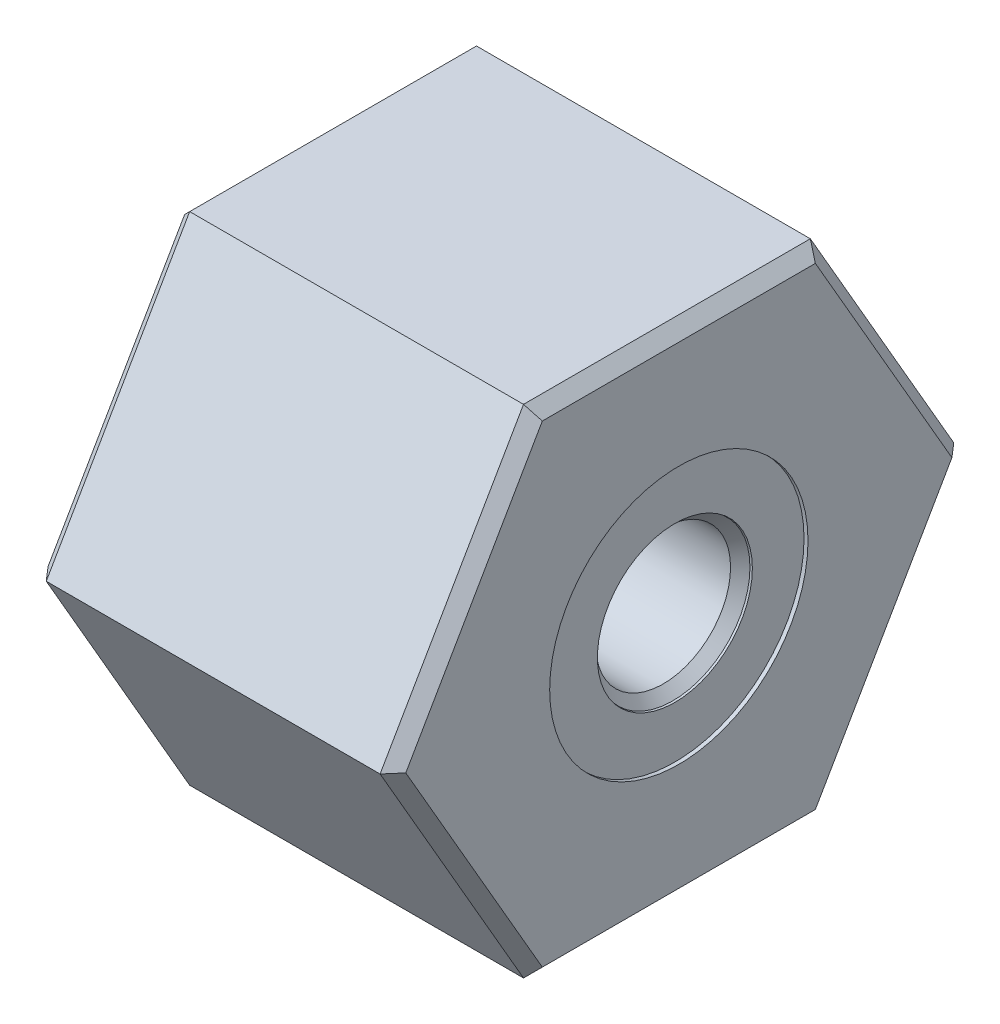
ISO-10303-21;
HEADER;
FILE_DESCRIPTION(('STEP AP214'),'2;1');
FILE_NAME('part.step','',(''),(''),'','','');
FILE_SCHEMA(('AUTOMOTIVE_DESIGN { 1 0 10303 214 1 1 1 1 }'));
ENDSEC;
DATA;
#1=APPLICATION_CONTEXT('core data for automotive mechanical design processes');
#2=APPLICATION_PROTOCOL_DEFINITION('international standard','automotive_design',2000,#1);
#3=PRODUCT_CONTEXT('',#1,'mechanical');
#4=PRODUCT('Part','Part','',(#3));
#5=PRODUCT_RELATED_PRODUCT_CATEGORY('part','',(#4));
#6=PRODUCT_DEFINITION_FORMATION('','',#4);
#7=PRODUCT_DEFINITION_CONTEXT('part definition',#1,'design');
#8=PRODUCT_DEFINITION('design','',#6,#7);
#9=PRODUCT_DEFINITION_SHAPE('','',#8);
#10=(LENGTH_UNIT() NAMED_UNIT(*) SI_UNIT(.MILLI.,.METRE.));
#11=(NAMED_UNIT(*) PLANE_ANGLE_UNIT() SI_UNIT($,.RADIAN.));
#12=(NAMED_UNIT(*) SI_UNIT($,.STERADIAN.) SOLID_ANGLE_UNIT());
#13=UNCERTAINTY_MEASURE_WITH_UNIT(LENGTH_MEASURE(1.E-05),#10,'distance_accuracy_value','');
#14=(GEOMETRIC_REPRESENTATION_CONTEXT(3) GLOBAL_UNCERTAINTY_ASSIGNED_CONTEXT((#13)) GLOBAL_UNIT_ASSIGNED_CONTEXT((#10,
#11,#12)) REPRESENTATION_CONTEXT('',''));
#15=CARTESIAN_POINT('',(0.,0.,0.));
#16=DIRECTION('',(0.,0.,1.));
#17=DIRECTION('',(1.,0.,0.));
#18=AXIS2_PLACEMENT_3D('',#15,#16,#17);
#19=CARTESIAN_POINT('',(22.86,0.,-18.3308710467706));
#20=DIRECTION('',(0.,-0.5,0.866025403784439));
#21=DIRECTION('',(0.,-0.866025403784439,-0.5));
#22=AXIS2_PLACEMENT_3D('',#19,#20,#21);
#23=PLANE('',#22);
#24=DIRECTION('',(-1.,0.,0.));
#25=VECTOR('',#24,1.);
#26=CARTESIAN_POINT('',(22.86,15.875,-9.16543552338531));
#27=LINE('',#26,#25);
#28=CARTESIAN_POINT('',(22.098,15.875,-9.16543552338531));
#29=VERTEX_POINT('',#28);
#30=CARTESIAN_POINT('',(0.761999999999999,15.875,-9.16543552338531));
#31=VERTEX_POINT('',#30);
#32=EDGE_CURVE('E122',#29,#31,#27,.T.);
#33=ORIENTED_EDGE('',*,*,#32,.F.);
#34=DIRECTION('',(0.,-0.866025403784439,-0.5));
#35=VECTOR('',#34,1.);
#36=CARTESIAN_POINT('',(22.098,0.,-18.3308710467706));
#37=LINE('',#36,#35);
#38=CARTESIAN_POINT('',(22.098,0.,-18.3308710467706));
#39=VERTEX_POINT('',#38);
#40=EDGE_CURVE('E212',#29,#39,#37,.T.);
#41=ORIENTED_EDGE('',*,*,#40,.T.);
#42=DIRECTION('',(-1.,0.,0.));
#43=VECTOR('',#42,1.);
#44=CARTESIAN_POINT('',(22.86,0.,-18.3308710467706));
#45=LINE('',#44,#43);
#46=CARTESIAN_POINT('',(0.761999999999999,0.,-18.3308710467706));
#47=VERTEX_POINT('',#46);
#48=EDGE_CURVE('E159',#39,#47,#45,.T.);
#49=ORIENTED_EDGE('',*,*,#48,.T.);
#50=DIRECTION('',(0.,0.866025403784439,0.5));
#51=VECTOR('',#50,1.);
#52=CARTESIAN_POINT('',(0.761999999999999,0.,-18.3308710467706));
#53=LINE('',#52,#51);
#54=EDGE_CURVE('E143',#47,#31,#53,.T.);
#55=ORIENTED_EDGE('',*,*,#54,.T.);
#56=EDGE_LOOP('',(#33,#41,#49,#55));
#57=FACE_BOUND('',#56,.T.);
#58=ADVANCED_FACE('F32',(#57),#23,.F.);
#59=CARTESIAN_POINT('',(22.86,15.875,-9.16543552338531));
#60=DIRECTION('',(0.,-1.,0.));
#61=DIRECTION('',(0.,0.,-1.));
#62=AXIS2_PLACEMENT_3D('',#59,#60,#61);
#63=PLANE('',#62);
#64=DIRECTION('',(-1.,0.,0.));
#65=VECTOR('',#64,1.);
#66=CARTESIAN_POINT('',(22.86,15.875,9.16543552338531));
#67=LINE('',#66,#65);
#68=CARTESIAN_POINT('',(22.098,15.875,9.16543552338531));
#69=VERTEX_POINT('',#68);
#70=CARTESIAN_POINT('',(0.761999999999999,15.875,9.16543552338531));
#71=VERTEX_POINT('',#70);
#72=EDGE_CURVE('E135',#69,#71,#67,.T.);
#73=ORIENTED_EDGE('',*,*,#72,.F.);
#74=DIRECTION('',(0.,0.,-1.));
#75=VECTOR('',#74,1.);
#76=CARTESIAN_POINT('',(22.098,15.875,-9.16543552338531));
#77=LINE('',#76,#75);
#78=EDGE_CURVE('E129',#69,#29,#77,.T.);
#79=ORIENTED_EDGE('',*,*,#78,.T.);
#80=ORIENTED_EDGE('',*,*,#32,.T.);
#81=DIRECTION('',(0.,0.,1.));
#82=VECTOR('',#81,1.);
#83=CARTESIAN_POINT('',(0.761999999999999,15.875,-9.16543552338531));
#84=LINE('',#83,#82);
#85=EDGE_CURVE('E126',#31,#71,#84,.T.);
#86=ORIENTED_EDGE('',*,*,#85,.T.);
#87=EDGE_LOOP('',(#73,#79,#80,#86));
#88=FACE_BOUND('',#87,.T.);
#89=ADVANCED_FACE('F124',(#88),#63,.F.);
#90=CARTESIAN_POINT('',(22.86,15.875,9.16543552338531));
#91=DIRECTION('',(0.,-0.5,-0.866025403784439));
#92=DIRECTION('',(0.,0.866025403784439,-0.5));
#93=AXIS2_PLACEMENT_3D('',#90,#91,#92);
#94=PLANE('',#93);
#95=DIRECTION('',(-1.,0.,0.));
#96=VECTOR('',#95,1.);
#97=CARTESIAN_POINT('',(22.86,0.,18.3308710467706));
#98=LINE('',#97,#96);
#99=CARTESIAN_POINT('',(22.098,0.,18.3308710467706));
#100=VERTEX_POINT('',#99);
#101=CARTESIAN_POINT('',(0.761999999999999,0.,18.3308710467706));
#102=VERTEX_POINT('',#101);
#103=EDGE_CURVE('E330',#100,#102,#98,.T.);
#104=ORIENTED_EDGE('',*,*,#103,.F.);
#105=DIRECTION('',(0.,0.866025403784439,-0.5));
#106=VECTOR('',#105,1.);
#107=CARTESIAN_POINT('',(22.098,15.875,9.16543552338531));
#108=LINE('',#107,#106);
#109=EDGE_CURVE('E54',#100,#69,#108,.T.);
#110=ORIENTED_EDGE('',*,*,#109,.T.);
#111=ORIENTED_EDGE('',*,*,#72,.T.);
#112=DIRECTION('',(0.,-0.866025403784439,0.5));
#113=VECTOR('',#112,1.);
#114=CARTESIAN_POINT('',(0.761999999999999,15.875,9.16543552338531));
#115=LINE('',#114,#113);
#116=EDGE_CURVE('E156',#71,#102,#115,.T.);
#117=ORIENTED_EDGE('',*,*,#116,.T.);
#118=EDGE_LOOP('',(#104,#110,#111,#117));
#119=FACE_BOUND('',#118,.T.);
#120=ADVANCED_FACE('F256',(#119),#94,.F.);
#121=CARTESIAN_POINT('',(22.86,0.,18.3308710467706));
#122=DIRECTION('',(0.,0.5,-0.866025403784439));
#123=DIRECTION('',(0.,0.866025403784439,0.5));
#124=AXIS2_PLACEMENT_3D('',#121,#122,#123);
#125=PLANE('',#124);
#126=DIRECTION('',(-1.,0.,0.));
#127=VECTOR('',#126,1.);
#128=CARTESIAN_POINT('',(22.86,-15.875,9.1654355233853));
#129=LINE('',#128,#127);
#130=CARTESIAN_POINT('',(22.098,-15.875,9.1654355233853));
#131=VERTEX_POINT('',#130);
#132=CARTESIAN_POINT('',(0.761999999999999,-15.875,9.1654355233853));
#133=VERTEX_POINT('',#132);
#134=EDGE_CURVE('E322',#131,#133,#129,.T.);
#135=ORIENTED_EDGE('',*,*,#134,.F.);
#136=DIRECTION('',(0.,0.866025403784439,0.5));
#137=VECTOR('',#136,1.);
#138=CARTESIAN_POINT('',(22.098,0.,18.3308710467706));
#139=LINE('',#138,#137);
#140=EDGE_CURVE('E47',#131,#100,#139,.T.);
#141=ORIENTED_EDGE('',*,*,#140,.T.);
#142=ORIENTED_EDGE('',*,*,#103,.T.);
#143=DIRECTION('',(0.,-0.866025403784439,-0.5));
#144=VECTOR('',#143,1.);
#145=CARTESIAN_POINT('',(0.761999999999999,0.,18.3308710467706));
#146=LINE('',#145,#144);
#147=EDGE_CURVE('E183',#102,#133,#146,.T.);
#148=ORIENTED_EDGE('',*,*,#147,.T.);
#149=EDGE_LOOP('',(#135,#141,#142,#148));
#150=FACE_BOUND('',#149,.T.);
#151=ADVANCED_FACE('F355',(#150),#125,.F.);
#152=CARTESIAN_POINT('',(22.86,-15.875,9.1654355233853));
#153=DIRECTION('',(0.,1.,0.));
#154=DIRECTION('',(0.,0.,1.));
#155=AXIS2_PLACEMENT_3D('',#152,#153,#154);
#156=PLANE('',#155);
#157=DIRECTION('',(-1.,0.,0.));
#158=VECTOR('',#157,1.);
#159=CARTESIAN_POINT('',(22.86,-15.875,-9.16543552338531));
#160=LINE('',#159,#158);
#161=CARTESIAN_POINT('',(22.098,-15.875,-9.16543552338531));
#162=VERTEX_POINT('',#161);
#163=CARTESIAN_POINT('',(0.761999999999999,-15.875,-9.16543552338531));
#164=VERTEX_POINT('',#163);
#165=EDGE_CURVE('E319',#162,#164,#160,.T.);
#166=ORIENTED_EDGE('',*,*,#165,.F.);
#167=DIRECTION('',(0.,0.,1.));
#168=VECTOR('',#167,1.);
#169=CARTESIAN_POINT('',(22.098,-15.875,9.1654355233853));
#170=LINE('',#169,#168);
#171=EDGE_CURVE('E216',#162,#131,#170,.T.);
#172=ORIENTED_EDGE('',*,*,#171,.T.);
#173=ORIENTED_EDGE('',*,*,#134,.T.);
#174=DIRECTION('',(0.,0.,-1.));
#175=VECTOR('',#174,1.);
#176=CARTESIAN_POINT('',(0.761999999999999,-15.875,9.1654355233853));
#177=LINE('',#176,#175);
#178=EDGE_CURVE('E180',#133,#164,#177,.T.);
#179=ORIENTED_EDGE('',*,*,#178,.T.);
#180=EDGE_LOOP('',(#166,#172,#173,#179));
#181=FACE_BOUND('',#180,.T.);
#182=ADVANCED_FACE('F352',(#181),#156,.F.);
#183=CARTESIAN_POINT('',(22.86,-15.875,-9.16543552338531));
#184=DIRECTION('',(0.,0.5,0.866025403784439));
#185=DIRECTION('',(0.,-0.866025403784439,0.5));
#186=AXIS2_PLACEMENT_3D('',#183,#184,#185);
#187=PLANE('',#186);
#188=ORIENTED_EDGE('',*,*,#48,.F.);
#189=DIRECTION('',(0.,-0.866025403784439,0.5));
#190=VECTOR('',#189,1.);
#191=CARTESIAN_POINT('',(22.098,-15.875,-9.16543552338531));
#192=LINE('',#191,#190);
#193=EDGE_CURVE('E214',#39,#162,#192,.T.);
#194=ORIENTED_EDGE('',*,*,#193,.T.);
#195=ORIENTED_EDGE('',*,*,#165,.T.);
#196=DIRECTION('',(0.,0.866025403784439,-0.5));
#197=VECTOR('',#196,1.);
#198=CARTESIAN_POINT('',(0.761999999999999,-15.875,-9.16543552338531));
#199=LINE('',#198,#197);
#200=EDGE_CURVE('E178',#164,#47,#199,.T.);
#201=ORIENTED_EDGE('',*,*,#200,.T.);
#202=EDGE_LOOP('',(#188,#194,#195,#201));
#203=FACE_BOUND('',#202,.T.);
#204=ADVANCED_FACE('F315',(#203),#187,.F.);
#205=CARTESIAN_POINT('',(22.86,15.875,-9.16543552338531));
#206=DIRECTION('',(1.,0.,0.));
#207=DIRECTION('',(0.,0.,-1.));
#208=AXIS2_PLACEMENT_3D('',#205,#206,#207);
#209=PLANE('',#208);
#210=DIRECTION('',(0.,0.866025403784439,-0.5));
#211=VECTOR('',#210,1.);
#212=CARTESIAN_POINT('',(22.86,0.380999999999991,-17.6709596890869));
#213=LINE('',#212,#211);
#214=CARTESIAN_POINT('',(22.86,-15.113,-8.72549461826283));
#215=VERTEX_POINT('',#214);
#216=CARTESIAN_POINT('',(22.86,0.,-17.4509892365257));
#217=VERTEX_POINT('',#216);
#218=EDGE_CURVE('E207',#215,#217,#213,.T.);
#219=ORIENTED_EDGE('',*,*,#218,.T.);
#220=DIRECTION('',(0.,0.866025403784439,0.5));
#221=VECTOR('',#220,1.);
#222=CARTESIAN_POINT('',(22.86,15.494,-8.50552416570158));
#223=LINE('',#222,#221);
#224=CARTESIAN_POINT('',(22.86,15.113,-8.72549461826283));
#225=VERTEX_POINT('',#224);
#226=EDGE_CURVE('E209',#217,#225,#223,.T.);
#227=ORIENTED_EDGE('',*,*,#226,.T.);
#228=DIRECTION('',(0.,0.,1.));
#229=VECTOR('',#228,1.);
#230=CARTESIAN_POINT('',(22.86,15.113,9.16543552338531));
#231=LINE('',#230,#229);
#232=CARTESIAN_POINT('',(22.86,15.113,8.72549461826282));
#233=VERTEX_POINT('',#232);
#234=EDGE_CURVE('E203',#225,#233,#231,.T.);
#235=ORIENTED_EDGE('',*,*,#234,.T.);
#236=DIRECTION('',(0.,-0.866025403784439,0.5));
#237=VECTOR('',#236,1.);
#238=CARTESIAN_POINT('',(22.86,-0.380999999999996,17.6709596890869));
#239=LINE('',#238,#237);
#240=CARTESIAN_POINT('',(22.86,0.,17.4509892365256));
#241=VERTEX_POINT('',#240);
#242=EDGE_CURVE('E201',#233,#241,#239,.T.);
#243=ORIENTED_EDGE('',*,*,#242,.T.);
#244=DIRECTION('',(0.,-0.866025403784439,-0.5));
#245=VECTOR('',#244,1.);
#246=CARTESIAN_POINT('',(22.86,-15.494,8.50552416570157));
#247=LINE('',#246,#245);
#248=CARTESIAN_POINT('',(22.86,-15.113,8.72549461826281));
#249=VERTEX_POINT('',#248);
#250=EDGE_CURVE('E155',#241,#249,#247,.T.);
#251=ORIENTED_EDGE('',*,*,#250,.T.);
#252=DIRECTION('',(0.,0.,-1.));
#253=VECTOR('',#252,1.);
#254=CARTESIAN_POINT('',(22.86,-15.113,-9.16543552338531));
#255=LINE('',#254,#253);
#256=EDGE_CURVE('E205',#249,#215,#255,.T.);
#257=ORIENTED_EDGE('',*,*,#256,.T.);
#258=EDGE_LOOP('',(#219,#227,#235,#243,#251,#257));
#259=FACE_BOUND('',#258,.T.);
#260=CARTESIAN_POINT('',(22.86,0.,0.));
#261=DIRECTION('',(1.,0.,0.));
#262=DIRECTION('',(0.,0.,-1.));
#263=AXIS2_PLACEMENT_3D('',#260,#261,#262);
#264=CIRCLE('',#263,8.255);
#265=CARTESIAN_POINT('',(22.86,0.,-8.255));
#266=VERTEX_POINT('',#265);
#267=EDGE_CURVE('E320',#266,#266,#264,.T.);
#268=ORIENTED_EDGE('',*,*,#267,.F.);
#269=EDGE_LOOP('',(#268));
#270=FACE_BOUND('',#269,.T.);
#271=ADVANCED_FACE('F338',(#259,#270),#209,.T.);
#272=CARTESIAN_POINT('',(0.,15.875,-9.16543552338531));
#273=DIRECTION('',(1.,0.,0.));
#274=DIRECTION('',(0.,0.,-1.));
#275=AXIS2_PLACEMENT_3D('',#272,#273,#274);
#276=PLANE('',#275);
#277=DIRECTION('',(0.,0.,-1.));
#278=VECTOR('',#277,1.);
#279=CARTESIAN_POINT('',(0.,15.113,-9.16543552338531));
#280=LINE('',#279,#278);
#281=CARTESIAN_POINT('',(0.,15.113,8.72549461826282));
#282=VERTEX_POINT('',#281);
#283=CARTESIAN_POINT('',(0.,15.113,-8.72549461826282));
#284=VERTEX_POINT('',#283);
#285=EDGE_CURVE('E161',#282,#284,#280,.T.);
#286=ORIENTED_EDGE('',*,*,#285,.T.);
#287=DIRECTION('',(0.,-0.866025403784439,-0.5));
#288=VECTOR('',#287,1.);
#289=CARTESIAN_POINT('',(0.,15.494,-8.50552416570158));
#290=LINE('',#289,#288);
#291=CARTESIAN_POINT('',(0.,0.,-17.4509892365257));
#292=VERTEX_POINT('',#291);
#293=EDGE_CURVE('E145',#284,#292,#290,.T.);
#294=ORIENTED_EDGE('',*,*,#293,.T.);
#295=DIRECTION('',(0.,-0.866025403784439,0.5));
#296=VECTOR('',#295,1.);
#297=CARTESIAN_POINT('',(0.,8.3185,-22.2536774507796));
#298=LINE('',#297,#296);
#299=CARTESIAN_POINT('',(0.,-15.113,-8.72549461826283));
#300=VERTEX_POINT('',#299);
#301=EDGE_CURVE('E175',#292,#300,#298,.T.);
#302=ORIENTED_EDGE('',*,*,#301,.T.);
#303=DIRECTION('',(0.,0.,1.));
#304=VECTOR('',#303,1.);
#305=CARTESIAN_POINT('',(0.,-15.113,-9.16543552338531));
#306=LINE('',#305,#304);
#307=CARTESIAN_POINT('',(0.,-15.113,8.72549461826281));
#308=VERTEX_POINT('',#307);
#309=EDGE_CURVE('E173',#300,#308,#306,.T.);
#310=ORIENTED_EDGE('',*,*,#309,.T.);
#311=DIRECTION('',(0.,0.866025403784439,0.5));
#312=VECTOR('',#311,1.);
#313=CARTESIAN_POINT('',(0.,0.380999999999999,17.6709596890869));
#314=LINE('',#313,#312);
#315=CARTESIAN_POINT('',(0.,0.,17.4509892365256));
#316=VERTEX_POINT('',#315);
#317=EDGE_CURVE('E171',#308,#316,#314,.T.);
#318=ORIENTED_EDGE('',*,*,#317,.T.);
#319=DIRECTION('',(0.,0.866025403784439,-0.5));
#320=VECTOR('',#319,1.);
#321=CARTESIAN_POINT('',(0.,23.4315,3.92280640400892));
#322=LINE('',#321,#320);
#323=EDGE_CURVE('E164',#316,#282,#322,.T.);
#324=ORIENTED_EDGE('',*,*,#323,.T.);
#325=EDGE_LOOP('',(#286,#294,#302,#310,#318,#324));
#326=FACE_BOUND('',#325,.T.);
#327=CARTESIAN_POINT('',(0.,0.,0.));
#328=DIRECTION('',(1.,0.,0.));
#329=DIRECTION('',(0.,0.,-1.));
#330=AXIS2_PLACEMENT_3D('',#327,#328,#329);
#331=CIRCLE('',#330,12.5094999999999);
#332=CARTESIAN_POINT('',(0.,0.,-12.5094999999999));
#333=VERTEX_POINT('',#332);
#334=EDGE_CURVE('E134',#333,#333,#331,.T.);
#335=ORIENTED_EDGE('',*,*,#334,.T.);
#336=EDGE_LOOP('',(#335));
#337=FACE_BOUND('',#336,.T.);
#338=ADVANCED_FACE('F335',(#326,#337),#276,.F.);
#339=CARTESIAN_POINT('',(0.,0.,0.));
#340=DIRECTION('',(1.,0.,0.));
#341=DIRECTION('',(0.,0.,-1.));
#342=AXIS2_PLACEMENT_3D('',#339,#340,#341);
#343=CYLINDRICAL_SURFACE('',#342,12.2555);
#344=CARTESIAN_POINT('',(9.652,0.,0.));
#345=DIRECTION('',(1.,0.,0.));
#346=DIRECTION('',(0.,0.,-1.));
#347=AXIS2_PLACEMENT_3D('',#344,#345,#346);
#348=CIRCLE('',#347,12.2555);
#349=CARTESIAN_POINT('',(9.652,0.,-12.2555));
#350=VERTEX_POINT('',#349);
#351=EDGE_CURVE('E40',#350,#350,#348,.T.);
#352=ORIENTED_EDGE('',*,*,#351,.T.);
#353=EDGE_LOOP('',(#352));
#354=FACE_BOUND('',#353,.T.);
#355=CARTESIAN_POINT('',(0.253999999999933,0.,0.));
#356=DIRECTION('',(1.,0.,0.));
#357=DIRECTION('',(0.,0.,-1.));
#358=AXIS2_PLACEMENT_3D('',#355,#356,#357);
#359=CIRCLE('',#358,12.2555);
#360=CARTESIAN_POINT('',(0.253999999999933,0.,-12.2555));
#361=VERTEX_POINT('',#360);
#362=EDGE_CURVE('E162',#361,#361,#359,.F.);
#363=ORIENTED_EDGE('',*,*,#362,.T.);
#364=EDGE_LOOP('',(#363));
#365=FACE_BOUND('',#364,.T.);
#366=ADVANCED_FACE('F238',(#354,#365),#343,.F.);
#367=CARTESIAN_POINT('',(0.,0.,0.));
#368=DIRECTION('',(1.,0.,0.));
#369=DIRECTION('',(0.,0.,-1.));
#370=AXIS2_PLACEMENT_3D('',#367,#368,#369);
#371=CYLINDRICAL_SURFACE('',#370,8.255);
#372=CARTESIAN_POINT('',(22.606,0.,0.));
#373=DIRECTION('',(1.,0.,0.));
#374=DIRECTION('',(0.,0.,-1.));
#375=AXIS2_PLACEMENT_3D('',#372,#373,#374);
#376=CIRCLE('',#375,8.255);
#377=CARTESIAN_POINT('',(22.606,0.,-8.255));
#378=VERTEX_POINT('',#377);
#379=EDGE_CURVE('E325',#378,#378,#376,.T.);
#380=ORIENTED_EDGE('',*,*,#379,.F.);
#381=EDGE_LOOP('',(#380));
#382=FACE_BOUND('',#381,.T.);
#383=ORIENTED_EDGE('',*,*,#267,.T.);
#384=EDGE_LOOP('',(#383));
#385=FACE_BOUND('',#384,.T.);
#386=ADVANCED_FACE('F345',(#382,#385),#371,.F.);
#387=CARTESIAN_POINT('',(22.606,8.255,0.));
#388=DIRECTION('',(-1.,0.,0.));
#389=DIRECTION('',(0.,0.,1.));
#390=AXIS2_PLACEMENT_3D('',#387,#388,#389);
#391=PLANE('',#390);
#392=CARTESIAN_POINT('',(22.606,0.,0.));
#393=DIRECTION('',(1.,0.,0.));
#394=DIRECTION('',(0.,0.,-1.));
#395=AXIS2_PLACEMENT_3D('',#392,#393,#394);
#396=CIRCLE('',#395,4.953);
#397=CARTESIAN_POINT('',(22.606,0.,-4.953));
#398=VERTEX_POINT('',#397);
#399=EDGE_CURVE('E434',#398,#398,#396,.T.);
#400=ORIENTED_EDGE('',*,*,#399,.F.);
#401=EDGE_LOOP('',(#400));
#402=FACE_BOUND('',#401,.T.);
#403=ORIENTED_EDGE('',*,*,#379,.T.);
#404=EDGE_LOOP('',(#403));
#405=FACE_BOUND('',#404,.T.);
#406=ADVANCED_FACE('F376',(#402,#405),#391,.F.);
#407=CARTESIAN_POINT('',(22.606,0.,0.));
#408=DIRECTION('',(1.,0.,0.));
#409=DIRECTION('',(0.,0.,-1.));
#410=AXIS2_PLACEMENT_3D('',#407,#408,#409);
#411=CONICAL_SURFACE('',#410,4.953,0.20943951023931);
#412=CARTESIAN_POINT('',(22.479,0.,0.));
#413=DIRECTION('',(1.,0.,0.));
#414=DIRECTION('',(0.,0.,-1.));
#415=AXIS2_PLACEMENT_3D('',#412,#413,#414);
#416=CIRCLE('',#415,4.92600531666791);
#417=CARTESIAN_POINT('',(22.479,0.,-4.92600531666791));
#418=VERTEX_POINT('',#417);
#419=EDGE_CURVE('E431',#418,#418,#416,.T.);
#420=ORIENTED_EDGE('',*,*,#419,.F.);
#421=EDGE_LOOP('',(#420));
#422=FACE_BOUND('',#421,.T.);
#423=ORIENTED_EDGE('',*,*,#399,.T.);
#424=EDGE_LOOP('',(#423));
#425=FACE_BOUND('',#424,.T.);
#426=ADVANCED_FACE('F382',(#422,#425),#411,.F.);
#427=CARTESIAN_POINT('',(22.479,0.,0.));
#428=DIRECTION('',(1.,0.,0.));
#429=DIRECTION('',(0.,0.,-1.));
#430=AXIS2_PLACEMENT_3D('',#427,#428,#429);
#431=CONICAL_SURFACE('',#430,4.92600531666791,0.78539816339745);
#432=CARTESIAN_POINT('',(21.8582946833321,0.,0.));
#433=DIRECTION('',(1.,0.,0.));
#434=DIRECTION('',(0.,0.,-1.));
#435=AXIS2_PLACEMENT_3D('',#432,#433,#434);
#436=CIRCLE('',#435,4.3053);
#437=CARTESIAN_POINT('',(21.8582946833321,0.,-4.3053));
#438=VERTEX_POINT('',#437);
#439=EDGE_CURVE('E428',#438,#438,#436,.T.);
#440=ORIENTED_EDGE('',*,*,#439,.F.);
#441=EDGE_LOOP('',(#440));
#442=FACE_BOUND('',#441,.T.);
#443=ORIENTED_EDGE('',*,*,#419,.T.);
#444=EDGE_LOOP('',(#443));
#445=FACE_BOUND('',#444,.T.);
#446=ADVANCED_FACE('F389',(#442,#445),#431,.F.);
#447=CARTESIAN_POINT('',(0.,0.,0.));
#448=DIRECTION('',(1.,0.,0.));
#449=DIRECTION('',(0.,0.,-1.));
#450=AXIS2_PLACEMENT_3D('',#447,#448,#449);
#451=CYLINDRICAL_SURFACE('',#450,4.3053);
#452=CARTESIAN_POINT('',(15.24,0.,0.));
#453=DIRECTION('',(1.,0.,0.));
#454=DIRECTION('',(0.,0.,-1.));
#455=AXIS2_PLACEMENT_3D('',#452,#453,#454);
#456=CIRCLE('',#455,4.3053);
#457=CARTESIAN_POINT('',(15.24,0.,-4.3053));
#458=VERTEX_POINT('',#457);
#459=EDGE_CURVE('E425',#458,#458,#456,.T.);
#460=ORIENTED_EDGE('',*,*,#459,.F.);
#461=EDGE_LOOP('',(#460));
#462=FACE_BOUND('',#461,.T.);
#463=ORIENTED_EDGE('',*,*,#439,.T.);
#464=EDGE_LOOP('',(#463));
#465=FACE_BOUND('',#464,.T.);
#466=ADVANCED_FACE('F393',(#462,#465),#451,.F.);
#467=CARTESIAN_POINT('',(15.24,0.,0.));
#468=DIRECTION('',(-1.,0.,0.));
#469=DIRECTION('',(0.,0.,1.));
#470=AXIS2_PLACEMENT_3D('',#467,#468,#469);
#471=CONICAL_SURFACE('',#470,4.3053,0.785398163397451);
#472=CARTESIAN_POINT('',(14.478,0.,0.));
#473=DIRECTION('',(1.,0.,0.));
#474=DIRECTION('',(0.,0.,-1.));
#475=AXIS2_PLACEMENT_3D('',#472,#473,#474);
#476=CIRCLE('',#475,5.0673);
#477=CARTESIAN_POINT('',(14.478,0.,-5.0673));
#478=VERTEX_POINT('',#477);
#479=EDGE_CURVE('E420',#478,#478,#476,.T.);
#480=ORIENTED_EDGE('',*,*,#479,.F.);
#481=EDGE_LOOP('',(#480));
#482=FACE_BOUND('',#481,.T.);
#483=ORIENTED_EDGE('',*,*,#459,.T.);
#484=EDGE_LOOP('',(#483));
#485=FACE_BOUND('',#484,.T.);
#486=ADVANCED_FACE('F397',(#482,#485),#471,.F.);
#487=CARTESIAN_POINT('',(14.478,11.7221,0.));
#488=DIRECTION('',(1.,0.,0.));
#489=DIRECTION('',(0.,0.,-1.));
#490=AXIS2_PLACEMENT_3D('',#487,#488,#489);
#491=PLANE('',#490);
#492=CARTESIAN_POINT('',(14.478,0.,0.));
#493=DIRECTION('',(1.,0.,0.));
#494=DIRECTION('',(0.,0.,-1.));
#495=AXIS2_PLACEMENT_3D('',#492,#493,#494);
#496=CIRCLE('',#495,11.7221);
#497=CARTESIAN_POINT('',(14.478,0.,-11.7221));
#498=VERTEX_POINT('',#497);
#499=EDGE_CURVE('E417',#498,#498,#496,.T.);
#500=ORIENTED_EDGE('',*,*,#499,.F.);
#501=EDGE_LOOP('',(#500));
#502=FACE_BOUND('',#501,.T.);
#503=ORIENTED_EDGE('',*,*,#479,.T.);
#504=EDGE_LOOP('',(#503));
#505=FACE_BOUND('',#504,.T.);
#506=ADVANCED_FACE('F401',(#502,#505),#491,.F.);
#507=CARTESIAN_POINT('',(0.,0.,0.));
#508=DIRECTION('',(1.,0.,0.));
#509=DIRECTION('',(0.,0.,-1.));
#510=AXIS2_PLACEMENT_3D('',#507,#508,#509);
#511=CYLINDRICAL_SURFACE('',#510,11.7221);
#512=CARTESIAN_POINT('',(10.16,0.,0.));
#513=DIRECTION('',(1.,0.,0.));
#514=DIRECTION('',(0.,0.,-1.));
#515=AXIS2_PLACEMENT_3D('',#512,#513,#514);
#516=CIRCLE('',#515,11.7221);
#517=CARTESIAN_POINT('',(10.16,0.,-11.7221));
#518=VERTEX_POINT('',#517);
#519=EDGE_CURVE('E199',#518,#518,#516,.T.);
#520=ORIENTED_EDGE('',*,*,#519,.F.);
#521=EDGE_LOOP('',(#520));
#522=FACE_BOUND('',#521,.T.);
#523=ORIENTED_EDGE('',*,*,#499,.T.);
#524=EDGE_LOOP('',(#523));
#525=FACE_BOUND('',#524,.T.);
#526=ADVANCED_FACE('F405',(#522,#525),#511,.F.);
#527=CARTESIAN_POINT('',(10.16,11.7221,0.));
#528=DIRECTION('',(1.,0.,0.));
#529=DIRECTION('',(0.,0.,-1.));
#530=AXIS2_PLACEMENT_3D('',#527,#528,#529);
#531=PLANE('',#530);
#532=CARTESIAN_POINT('',(10.16,0.,0.));
#533=DIRECTION('',(1.,0.,0.));
#534=DIRECTION('',(0.,0.,-1.));
#535=AXIS2_PLACEMENT_3D('',#532,#533,#534);
#536=CIRCLE('',#535,11.7475);
#537=CARTESIAN_POINT('',(10.16,0.,-11.7475));
#538=VERTEX_POINT('',#537);
#539=EDGE_CURVE('E11',#538,#538,#536,.F.);
#540=ORIENTED_EDGE('',*,*,#539,.T.);
#541=EDGE_LOOP('',(#540));
#542=FACE_BOUND('',#541,.T.);
#543=ORIENTED_EDGE('',*,*,#519,.T.);
#544=EDGE_LOOP('',(#543));
#545=FACE_BOUND('',#544,.T.);
#546=ADVANCED_FACE('F264',(#542,#545),#531,.F.);
#547=CARTESIAN_POINT('',(0.,0.,0.));
#548=DIRECTION('',(-1.,0.,0.));
#549=DIRECTION('',(0.,0.,1.));
#550=AXIS2_PLACEMENT_3D('',#547,#548,#549);
#551=CONICAL_SURFACE('',#550,12.5094999999999,0.785398163397445);
#552=ORIENTED_EDGE('',*,*,#362,.F.);
#553=EDGE_LOOP('',(#552));
#554=FACE_BOUND('',#553,.T.);
#555=ORIENTED_EDGE('',*,*,#334,.F.);
#556=EDGE_LOOP('',(#555));
#557=FACE_BOUND('',#556,.T.);
#558=ADVANCED_FACE('F260',(#554,#557),#551,.F.);
#559=CARTESIAN_POINT('',(0.761999999999999,0.,18.3308710467706));
#560=DIRECTION('',(0.707106781186545,0.353553390593275,-0.612372435695797));
#561=DIRECTION('',(-0.65465367070798,0.,-0.755928946018452));
#562=AXIS2_PLACEMENT_3D('',#559,#560,#561);
#563=PLANE('',#562);
#564=DIRECTION('',(0.65465367070798,0.,0.755928946018452));
#565=VECTOR('',#564,1.);
#566=CARTESIAN_POINT('',(-3.77371428571429,0.,13.0934793191219));
#567=LINE('',#566,#565);
#568=EDGE_CURVE('E193',#316,#102,#567,.T.);
#569=ORIENTED_EDGE('',*,*,#568,.F.);
#570=ORIENTED_EDGE('',*,*,#317,.F.);
#571=DIRECTION('',(0.65465367070798,-0.654653670707974,0.377964473009227));
#572=VECTOR('',#571,1.);
#573=CARTESIAN_POINT('',(-3.77371428571429,-11.3392857142858,6.54673965956095));
#574=LINE('',#573,#572);
#575=EDGE_CURVE('E196',#133,#308,#574,.F.);
#576=ORIENTED_EDGE('',*,*,#575,.F.);
#577=ORIENTED_EDGE('',*,*,#147,.F.);
#578=EDGE_LOOP('',(#569,#570,#576,#577));
#579=FACE_BOUND('',#578,.T.);
#580=ADVANCED_FACE('F263',(#579),#563,.F.);
#581=CARTESIAN_POINT('',(0.761999999999999,-15.875,9.1654355233853));
#582=DIRECTION('',(0.707106781186544,0.707106781186551,0.));
#583=DIRECTION('',(-0.707106781186551,0.707106781186544,0.));
#584=AXIS2_PLACEMENT_3D('',#581,#582,#583);
#585=PLANE('',#584);
#586=ORIENTED_EDGE('',*,*,#575,.T.);
#587=ORIENTED_EDGE('',*,*,#309,.F.);
#588=DIRECTION('',(0.654653670707981,-0.654653670707975,-0.377964473009224));
#589=VECTOR('',#588,1.);
#590=CARTESIAN_POINT('',(-3.77371428571428,-11.3392857142858,-6.54673965956098));
#591=LINE('',#590,#589);
#592=EDGE_CURVE('E190',#164,#300,#591,.F.);
#593=ORIENTED_EDGE('',*,*,#592,.F.);
#594=ORIENTED_EDGE('',*,*,#178,.F.);
#595=EDGE_LOOP('',(#586,#587,#593,#594));
#596=FACE_BOUND('',#595,.T.);
#597=ADVANCED_FACE('F278',(#596),#585,.F.);
#598=CARTESIAN_POINT('',(0.761999999999999,15.875,9.16543552338531));
#599=DIRECTION('',(0.707106781186545,-0.353553390593275,-0.612372435695797));
#600=DIRECTION('',(-0.65465367070798,0.,-0.755928946018452));
#601=AXIS2_PLACEMENT_3D('',#598,#599,#600);
#602=PLANE('',#601);
#603=ORIENTED_EDGE('',*,*,#568,.T.);
#604=ORIENTED_EDGE('',*,*,#116,.F.);
#605=DIRECTION('',(0.65465367070798,0.654653670707974,0.377964473009227));
#606=VECTOR('',#605,1.);
#607=CARTESIAN_POINT('',(-3.77371428571431,11.3392857142857,6.54673965956093));
#608=LINE('',#607,#606);
#609=EDGE_CURVE('E154',#282,#71,#608,.T.);
#610=ORIENTED_EDGE('',*,*,#609,.F.);
#611=ORIENTED_EDGE('',*,*,#323,.F.);
#612=EDGE_LOOP('',(#603,#604,#610,#611));
#613=FACE_BOUND('',#612,.T.);
#614=ADVANCED_FACE('F274',(#613),#602,.F.);
#615=CARTESIAN_POINT('',(0.761999999999999,-15.875,-9.16543552338531));
#616=DIRECTION('',(0.707106781186543,0.353553390593276,0.612372435695798));
#617=DIRECTION('',(0.654653670707981,0.,-0.755928946018451));
#618=AXIS2_PLACEMENT_3D('',#615,#616,#617);
#619=PLANE('',#618);
#620=ORIENTED_EDGE('',*,*,#592,.T.);
#621=ORIENTED_EDGE('',*,*,#301,.F.);
#622=DIRECTION('',(0.654653670707981,0.,-0.755928946018451));
#623=VECTOR('',#622,1.);
#624=CARTESIAN_POINT('',(-3.77371428571431,0.,-13.0934793191219));
#625=LINE('',#624,#623);
#626=EDGE_CURVE('E148',#47,#292,#625,.F.);
#627=ORIENTED_EDGE('',*,*,#626,.F.);
#628=ORIENTED_EDGE('',*,*,#200,.F.);
#629=EDGE_LOOP('',(#620,#621,#627,#628));
#630=FACE_BOUND('',#629,.T.);
#631=ADVANCED_FACE('F271',(#630),#619,.F.);
#632=CARTESIAN_POINT('',(0.761999999999999,15.875,-9.16543552338531));
#633=DIRECTION('',(0.707106781186544,-0.707106781186551,0.));
#634=DIRECTION('',(0.707106781186551,0.707106781186544,0.));
#635=AXIS2_PLACEMENT_3D('',#632,#633,#634);
#636=PLANE('',#635);
#637=ORIENTED_EDGE('',*,*,#609,.T.);
#638=ORIENTED_EDGE('',*,*,#85,.F.);
#639=DIRECTION('',(-0.654653670707981,-0.654653670707975,0.377964473009226));
#640=VECTOR('',#639,1.);
#641=CARTESIAN_POINT('',(0.761999999999998,15.875,-9.16543552338531));
#642=LINE('',#641,#640);
#643=EDGE_CURVE('E141',#284,#31,#642,.F.);
#644=ORIENTED_EDGE('',*,*,#643,.F.);
#645=ORIENTED_EDGE('',*,*,#285,.F.);
#646=EDGE_LOOP('',(#637,#638,#644,#645));
#647=FACE_BOUND('',#646,.T.);
#648=ADVANCED_FACE('F152',(#647),#636,.F.);
#649=CARTESIAN_POINT('',(0.761999999999999,0.,-18.3308710467706));
#650=DIRECTION('',(0.707106781186544,-0.353553390593275,0.612372435695797));
#651=DIRECTION('',(0.654653670707981,0.,-0.755928946018451));
#652=AXIS2_PLACEMENT_3D('',#649,#650,#651);
#653=PLANE('',#652);
#654=ORIENTED_EDGE('',*,*,#626,.T.);
#655=ORIENTED_EDGE('',*,*,#293,.F.);
#656=ORIENTED_EDGE('',*,*,#643,.T.);
#657=ORIENTED_EDGE('',*,*,#54,.F.);
#658=EDGE_LOOP('',(#654,#655,#656,#657));
#659=FACE_BOUND('',#658,.T.);
#660=ADVANCED_FACE('F142',(#659),#653,.F.);
#661=CARTESIAN_POINT('',(22.86,0.380999999999998,17.6709596890869));
#662=DIRECTION('',(0.707106781186546,-0.353553390593274,0.612372435695796));
#663=DIRECTION('',(0.654653670707979,0.,-0.755928946018453));
#664=AXIS2_PLACEMENT_3D('',#661,#662,#663);
#665=PLANE('',#664);
#666=DIRECTION('',(-0.65465367070798,0.,0.755928946018452));
#667=VECTOR('',#666,1.);
#668=CARTESIAN_POINT('',(22.7511428571429,0.,17.5766866379892));
#669=LINE('',#668,#667);
#670=EDGE_CURVE('E231',#100,#241,#669,.F.);
#671=ORIENTED_EDGE('',*,*,#670,.F.);
#672=ORIENTED_EDGE('',*,*,#140,.F.);
#673=DIRECTION('',(0.65465367070798,0.654653670707974,-0.377964473009229));
#674=VECTOR('',#673,1.);
#675=CARTESIAN_POINT('',(27.2868571428571,-10.686142857143,6.16964745517023));
#676=LINE('',#675,#674);
#677=EDGE_CURVE('E149',#249,#131,#676,.F.);
#678=ORIENTED_EDGE('',*,*,#677,.F.);
#679=ORIENTED_EDGE('',*,*,#250,.F.);
#680=EDGE_LOOP('',(#671,#672,#678,#679));
#681=FACE_BOUND('',#680,.T.);
#682=ADVANCED_FACE('F268',(#681),#665,.T.);
#683=CARTESIAN_POINT('',(22.86,-15.113,-9.16543552338531));
#684=DIRECTION('',(0.707106781186544,-0.707106781186551,0.));
#685=DIRECTION('',(0.707106781186551,0.707106781186544,0.));
#686=AXIS2_PLACEMENT_3D('',#683,#684,#685);
#687=PLANE('',#686);
#688=ORIENTED_EDGE('',*,*,#677,.T.);
#689=ORIENTED_EDGE('',*,*,#171,.F.);
#690=DIRECTION('',(0.654653670707981,0.654653670707975,0.377964473009223));
#691=VECTOR('',#690,1.);
#692=CARTESIAN_POINT('',(22.7511428571429,-15.2218571428572,-8.78834331899462));
#693=LINE('',#692,#691);
#694=EDGE_CURVE('E228',#215,#162,#693,.F.);
#695=ORIENTED_EDGE('',*,*,#694,.F.);
#696=ORIENTED_EDGE('',*,*,#256,.F.);
#697=EDGE_LOOP('',(#688,#689,#695,#696));
#698=FACE_BOUND('',#697,.T.);
#699=ADVANCED_FACE('F296',(#698),#687,.T.);
#700=CARTESIAN_POINT('',(22.86,23.4315,3.92280640400893));
#701=DIRECTION('',(0.707106781186544,0.353553390593275,0.612372435695798));
#702=DIRECTION('',(0.654653670707981,0.,-0.755928946018451));
#703=AXIS2_PLACEMENT_3D('',#700,#701,#702);
#704=PLANE('',#703);
#705=ORIENTED_EDGE('',*,*,#670,.T.);
#706=ORIENTED_EDGE('',*,*,#242,.F.);
#707=DIRECTION('',(-0.654653670707981,0.654653670707975,0.377964473009225));
#708=VECTOR('',#707,1.);
#709=CARTESIAN_POINT('',(20.4832857142857,17.4897142857143,10.0976912509068));
#710=LINE('',#709,#708);
#711=EDGE_CURVE('E225',#69,#233,#710,.F.);
#712=ORIENTED_EDGE('',*,*,#711,.F.);
#713=ORIENTED_EDGE('',*,*,#109,.F.);
#714=EDGE_LOOP('',(#705,#706,#712,#713));
#715=FACE_BOUND('',#714,.T.);
#716=ADVANCED_FACE('F292',(#715),#704,.T.);
#717=CARTESIAN_POINT('',(22.86,8.3185,-22.2536774507796));
#718=DIRECTION('',(0.707106781186543,-0.353553390593276,-0.612372435695799));
#719=DIRECTION('',(-0.654653670707982,0.,-0.75592894601845));
#720=AXIS2_PLACEMENT_3D('',#717,#718,#719);
#721=PLANE('',#720);
#722=ORIENTED_EDGE('',*,*,#694,.T.);
#723=ORIENTED_EDGE('',*,*,#193,.F.);
#724=DIRECTION('',(0.654653670707981,0.,0.755928946018451));
#725=VECTOR('',#724,1.);
#726=CARTESIAN_POINT('',(20.4832857142857,0.,-20.1953825018136));
#727=LINE('',#726,#725);
#728=EDGE_CURVE('E223',#217,#39,#727,.F.);
#729=ORIENTED_EDGE('',*,*,#728,.F.);
#730=ORIENTED_EDGE('',*,*,#218,.F.);
#731=EDGE_LOOP('',(#722,#723,#729,#730));
#732=FACE_BOUND('',#731,.T.);
#733=ADVANCED_FACE('F288',(#732),#721,.T.);
#734=CARTESIAN_POINT('',(22.86,15.113,-9.16543552338531));
#735=DIRECTION('',(0.707106781186544,0.707106781186551,0.));
#736=DIRECTION('',(-0.707106781186551,0.707106781186544,0.));
#737=AXIS2_PLACEMENT_3D('',#734,#735,#736);
#738=PLANE('',#737);
#739=ORIENTED_EDGE('',*,*,#711,.T.);
#740=ORIENTED_EDGE('',*,*,#234,.F.);
#741=DIRECTION('',(-0.654653670707981,0.654653670707975,-0.377964473009226));
#742=VECTOR('',#741,1.);
#743=CARTESIAN_POINT('',(22.7511428571429,15.2218571428572,-8.78834331899461));
#744=LINE('',#743,#742);
#745=EDGE_CURVE('E221',#29,#225,#744,.F.);
#746=ORIENTED_EDGE('',*,*,#745,.F.);
#747=ORIENTED_EDGE('',*,*,#78,.F.);
#748=EDGE_LOOP('',(#739,#740,#746,#747));
#749=FACE_BOUND('',#748,.T.);
#750=ADVANCED_FACE('F247',(#749),#738,.T.);
#751=CARTESIAN_POINT('',(22.86,15.494,-8.50552416570158));
#752=DIRECTION('',(0.707106781186544,0.353553390593275,-0.612372435695797));
#753=DIRECTION('',(-0.654653670707981,0.,-0.755928946018451));
#754=AXIS2_PLACEMENT_3D('',#751,#752,#753);
#755=PLANE('',#754);
#756=ORIENTED_EDGE('',*,*,#728,.T.);
#757=ORIENTED_EDGE('',*,*,#40,.F.);
#758=ORIENTED_EDGE('',*,*,#745,.T.);
#759=ORIENTED_EDGE('',*,*,#226,.F.);
#760=EDGE_LOOP('',(#756,#757,#758,#759));
#761=FACE_BOUND('',#760,.T.);
#762=ADVANCED_FACE('F242',(#761),#755,.T.);
#763=CARTESIAN_POINT('',(9.652,0.,0.));
#764=DIRECTION('',(1.,0.,0.));
#765=DIRECTION('',(0.,0.,-1.));
#766=AXIS2_PLACEMENT_3D('',#763,#764,#765);
#767=TOROIDAL_SURFACE('',#766,11.7475,0.508);
#768=ORIENTED_EDGE('',*,*,#539,.F.);
#769=EDGE_LOOP('',(#768));
#770=FACE_BOUND('',#769,.T.);
#771=ORIENTED_EDGE('',*,*,#351,.F.);
#772=EDGE_LOOP('',(#771));
#773=FACE_BOUND('',#772,.T.);
#774=ADVANCED_FACE('F34',(#770,#773),#767,.F.);
#775=CLOSED_SHELL('',(#58,#89,#120,#151,#182,#204,#271,#338,#366,#386,#406,#426,#446,#466,#486,
#506,#526,#546,#558,#580,#597,#614,#631,#648,#660,#682,#699,#716,#733,#750,#762,#774));
#776=MANIFOLD_SOLID_BREP('B2',#775);
#777=ADVANCED_BREP_SHAPE_REPRESENTATION('',(#18,#776),#14);
#778=SHAPE_DEFINITION_REPRESENTATION(#9,#777);
ENDSEC;
END-ISO-10303-21;
